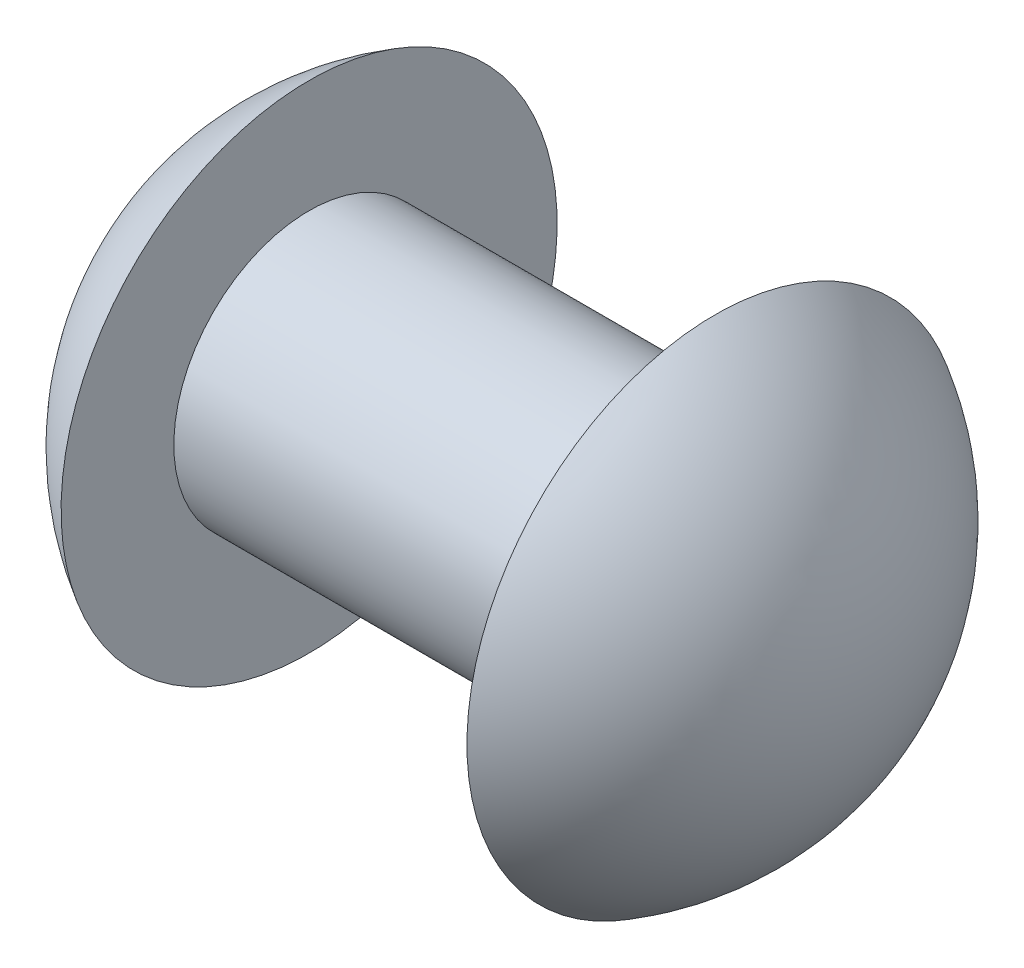
ISO-10303-21;
HEADER;
FILE_DESCRIPTION(('STEP AP214'),'2;1');
FILE_NAME('part.step','',(''),(''),'','','');
FILE_SCHEMA(('AUTOMOTIVE_DESIGN { 1 0 10303 214 1 1 1 1 }'));
ENDSEC;
DATA;
#1=APPLICATION_CONTEXT('core data for automotive mechanical design processes');
#2=APPLICATION_PROTOCOL_DEFINITION('international standard','automotive_design',2000,#1);
#3=PRODUCT_CONTEXT('',#1,'mechanical');
#4=PRODUCT('Part','Part','',(#3));
#5=PRODUCT_RELATED_PRODUCT_CATEGORY('part','',(#4));
#6=PRODUCT_DEFINITION_FORMATION('','',#4);
#7=PRODUCT_DEFINITION_CONTEXT('part definition',#1,'design');
#8=PRODUCT_DEFINITION('design','',#6,#7);
#9=PRODUCT_DEFINITION_SHAPE('','',#8);
#10=(LENGTH_UNIT() NAMED_UNIT(*) SI_UNIT(.MILLI.,.METRE.));
#11=(NAMED_UNIT(*) PLANE_ANGLE_UNIT() SI_UNIT($,.RADIAN.));
#12=(NAMED_UNIT(*) SI_UNIT($,.STERADIAN.) SOLID_ANGLE_UNIT());
#13=UNCERTAINTY_MEASURE_WITH_UNIT(LENGTH_MEASURE(1.E-05),#10,'distance_accuracy_value','');
#14=(GEOMETRIC_REPRESENTATION_CONTEXT(3) GLOBAL_UNCERTAINTY_ASSIGNED_CONTEXT((#13)) GLOBAL_UNIT_ASSIGNED_CONTEXT((#10,
#11,#12)) REPRESENTATION_CONTEXT('',''));
#15=CARTESIAN_POINT('',(0.,0.,0.));
#16=DIRECTION('',(0.,0.,1.));
#17=DIRECTION('',(1.,0.,0.));
#18=AXIS2_PLACEMENT_3D('',#15,#16,#17);
#19=CARTESIAN_POINT('',(25.4261455328048,92.7133930693418,96.5952082367726));
#20=DIRECTION('',(1.,0.,0.));
#21=DIRECTION('',(0.,-0.27779617289423,0.96064003993448));
#22=AXIS2_PLACEMENT_3D('',#19,#20,#21);
#23=PLANE('',#22);
#24=CARTESIAN_POINT('',(25.4261455328048,92.6099436647213,96.565292922506));
#25=DIRECTION('',(1.,0.,0.));
#26=DIRECTION('',(0.,-0.27779617289423,0.96064003993448));
#27=AXIS2_PLACEMENT_3D('',#24,#25,#26);
#28=CIRCLE('',#27,0.197428);
#29=CARTESIAN_POINT('',(25.4261455328048,92.5550989218991,96.7549501643102));
#30=VERTEX_POINT('',#29);
#31=EDGE_CURVE('E11',#30,#30,#28,.T.);
#32=ORIENTED_EDGE('',*,*,#31,.T.);
#33=EDGE_LOOP('',(#32));
#34=FACE_BOUND('',#33,.T.);
#35=CARTESIAN_POINT('',(25.4261455328048,92.6099436647213,96.565292922506));
#36=DIRECTION('',(1.,0.,0.));
#37=DIRECTION('',(0.,-0.27779617289423,0.96064003993448));
#38=AXIS2_PLACEMENT_3D('',#35,#36,#37);
#39=CIRCLE('',#38,0.107688);
#40=CARTESIAN_POINT('',(25.4261455328048,92.5800283504547,96.6687423271265));
#41=VERTEX_POINT('',#40);
#42=EDGE_CURVE('E59',#41,#41,#39,.T.);
#43=ORIENTED_EDGE('',*,*,#42,.F.);
#44=EDGE_LOOP('',(#43));
#45=FACE_BOUND('',#44,.T.);
#46=ADVANCED_FACE('F44',(#34,#45),#23,.T.);
#47=CARTESIAN_POINT('',(25.5367016445223,92.6099436647213,96.565292922506));
#48=DIRECTION('',(1.,0.,0.));
#49=DIRECTION('',(0.,0.96064003993448,0.27779617289423));
#50=AXIS2_PLACEMENT_3D('',#47,#48,#49);
#51=SPHERICAL_SURFACE('',#50,0.226275206379545);
#52=ORIENTED_EDGE('',*,*,#31,.F.);
#53=EDGE_LOOP('',(#52));
#54=FACE_BOUND('',#53,.T.);
#55=ADVANCED_FACE('F72',(#54),#51,.T.);
#56=CARTESIAN_POINT('',(25.6386534210872,92.6099436647213,96.565292922506));
#57=DIRECTION('',(1.,0.,0.));
#58=DIRECTION('',(0.,0.96064003993448,0.27779617289423));
#59=AXIS2_PLACEMENT_3D('',#56,#57,#58);
#60=SPHERICAL_SURFACE('',#59,0.226275206379545);
#61=CARTESIAN_POINT('',(25.7492095328048,92.6099436647213,96.565292922506));
#62=DIRECTION('',(1.,0.,0.));
#63=DIRECTION('',(0.,-0.27779617289423,0.96064003993448));
#64=AXIS2_PLACEMENT_3D('',#61,#62,#63);
#65=CIRCLE('',#64,0.197428);
#66=CARTESIAN_POINT('',(25.7492095328048,92.5550989218991,96.7549501643102));
#67=VERTEX_POINT('',#66);
#68=EDGE_CURVE('E51',#67,#67,#65,.T.);
#69=ORIENTED_EDGE('',*,*,#68,.T.);
#70=EDGE_LOOP('',(#69));
#71=FACE_BOUND('',#70,.T.);
#72=ADVANCED_FACE('F77',(#71),#60,.T.);
#73=CARTESIAN_POINT('',(25.7492095328048,92.7133930693418,96.5952082367726));
#74=DIRECTION('',(1.,0.,0.));
#75=DIRECTION('',(0.,-0.27779617289423,0.96064003993448));
#76=AXIS2_PLACEMENT_3D('',#73,#74,#75);
#77=PLANE('',#76);
#78=ORIENTED_EDGE('',*,*,#68,.F.);
#79=EDGE_LOOP('',(#78));
#80=FACE_BOUND('',#79,.T.);
#81=CARTESIAN_POINT('',(25.7492095328048,92.6099436647213,96.565292922506));
#82=DIRECTION('',(1.,0.,0.));
#83=DIRECTION('',(0.,-0.27779617289423,0.96064003993448));
#84=AXIS2_PLACEMENT_3D('',#81,#82,#83);
#85=CIRCLE('',#84,0.107688);
#86=CARTESIAN_POINT('',(25.7492095328048,92.5800283504547,96.6687423271265));
#87=VERTEX_POINT('',#86);
#88=EDGE_CURVE('E55',#87,#87,#85,.T.);
#89=ORIENTED_EDGE('',*,*,#88,.T.);
#90=EDGE_LOOP('',(#89));
#91=FACE_BOUND('',#90,.T.);
#92=ADVANCED_FACE('F83',(#80,#91),#77,.F.);
#93=CARTESIAN_POINT('',(25.8649286274667,92.6099436647213,96.565292922506));
#94=DIRECTION('',(1.,0.,0.));
#95=DIRECTION('',(0.,-0.27779617289423,0.96064003993448));
#96=AXIS2_PLACEMENT_3D('',#93,#94,#95);
#97=CYLINDRICAL_SURFACE('',#96,0.107688);
#98=ORIENTED_EDGE('',*,*,#88,.F.);
#99=EDGE_LOOP('',(#98));
#100=FACE_BOUND('',#99,.T.);
#101=ORIENTED_EDGE('',*,*,#42,.T.);
#102=EDGE_LOOP('',(#101));
#103=FACE_BOUND('',#102,.T.);
#104=ADVANCED_FACE('F69',(#100,#103),#97,.T.);
#105=CLOSED_SHELL('',(#46,#55,#72,#92,#104));
#106=MANIFOLD_SOLID_BREP('B2',#105);
#107=ADVANCED_BREP_SHAPE_REPRESENTATION('',(#18,#106),#14);
#108=SHAPE_DEFINITION_REPRESENTATION(#9,#107);
ENDSEC;
END-ISO-10303-21;
